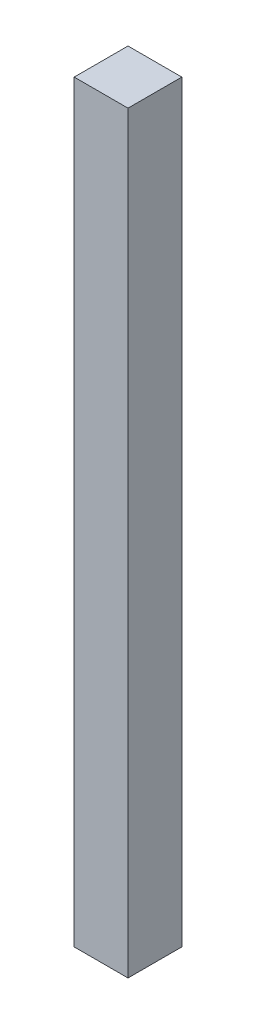
ISO-10303-21;
HEADER;
FILE_DESCRIPTION(('STEP AP214'),'2;1');
FILE_NAME('part.step','',(''),(''),'','','');
FILE_SCHEMA(('AUTOMOTIVE_DESIGN { 1 0 10303 214 1 1 1 1 }'));
ENDSEC;
DATA;
#1=APPLICATION_CONTEXT('core data for automotive mechanical design processes');
#2=APPLICATION_PROTOCOL_DEFINITION('international standard','automotive_design',2000,#1);
#3=PRODUCT_CONTEXT('',#1,'mechanical');
#4=PRODUCT('Part','Part','',(#3));
#5=PRODUCT_RELATED_PRODUCT_CATEGORY('part','',(#4));
#6=PRODUCT_DEFINITION_FORMATION('','',#4);
#7=PRODUCT_DEFINITION_CONTEXT('part definition',#1,'design');
#8=PRODUCT_DEFINITION('design','',#6,#7);
#9=PRODUCT_DEFINITION_SHAPE('','',#8);
#10=(LENGTH_UNIT() NAMED_UNIT(*) SI_UNIT(.MILLI.,.METRE.));
#11=(NAMED_UNIT(*) PLANE_ANGLE_UNIT() SI_UNIT($,.RADIAN.));
#12=(NAMED_UNIT(*) SI_UNIT($,.STERADIAN.) SOLID_ANGLE_UNIT());
#13=UNCERTAINTY_MEASURE_WITH_UNIT(LENGTH_MEASURE(1.E-05),#10,'distance_accuracy_value','');
#14=(GEOMETRIC_REPRESENTATION_CONTEXT(3) GLOBAL_UNCERTAINTY_ASSIGNED_CONTEXT((#13)) GLOBAL_UNIT_ASSIGNED_CONTEXT((#10,
#11,#12)) REPRESENTATION_CONTEXT('',''));
#15=CARTESIAN_POINT('',(0.,0.,0.));
#16=DIRECTION('',(0.,0.,1.));
#17=DIRECTION('',(1.,0.,0.));
#18=AXIS2_PLACEMENT_3D('',#15,#16,#17);
#19=CARTESIAN_POINT('',(0.,70.,0.));
#20=DIRECTION('',(1.,0.,0.));
#21=DIRECTION('',(0.,0.,-1.));
#22=AXIS2_PLACEMENT_3D('',#19,#20,#21);
#23=PLANE('',#22);
#24=DIRECTION('',(0.,0.,1.));
#25=VECTOR('',#24,1.);
#26=CARTESIAN_POINT('',(0.,0.,0.));
#27=LINE('',#26,#25);
#28=CARTESIAN_POINT('',(0.,0.,0.));
#29=VERTEX_POINT('',#28);
#30=CARTESIAN_POINT('',(0.,0.,5.));
#31=VERTEX_POINT('',#30);
#32=EDGE_CURVE('E96',#29,#31,#27,.T.);
#33=ORIENTED_EDGE('',*,*,#32,.T.);
#34=DIRECTION('',(0.,-1.,0.));
#35=VECTOR('',#34,1.);
#36=CARTESIAN_POINT('',(0.,70.,5.));
#37=LINE('',#36,#35);
#38=CARTESIAN_POINT('',(0.,70.,5.));
#39=VERTEX_POINT('',#38);
#40=EDGE_CURVE('E11',#39,#31,#37,.T.);
#41=ORIENTED_EDGE('',*,*,#40,.F.);
#42=DIRECTION('',(0.,0.,1.));
#43=VECTOR('',#42,1.);
#44=CARTESIAN_POINT('',(0.,70.,0.));
#45=LINE('',#44,#43);
#46=CARTESIAN_POINT('',(0.,70.,0.));
#47=VERTEX_POINT('',#46);
#48=EDGE_CURVE('E84',#47,#39,#45,.T.);
#49=ORIENTED_EDGE('',*,*,#48,.F.);
#50=DIRECTION('',(0.,-1.,0.));
#51=VECTOR('',#50,1.);
#52=CARTESIAN_POINT('',(0.,70.,0.));
#53=LINE('',#52,#51);
#54=EDGE_CURVE('E92',#47,#29,#53,.T.);
#55=ORIENTED_EDGE('',*,*,#54,.T.);
#56=EDGE_LOOP('',(#33,#41,#49,#55));
#57=FACE_BOUND('',#56,.T.);
#58=ADVANCED_FACE('F33',(#57),#23,.F.);
#59=CARTESIAN_POINT('',(0.,70.,5.));
#60=DIRECTION('',(0.,0.,-1.));
#61=DIRECTION('',(-1.,0.,0.));
#62=AXIS2_PLACEMENT_3D('',#59,#60,#61);
#63=PLANE('',#62);
#64=DIRECTION('',(1.,0.,0.));
#65=VECTOR('',#64,1.);
#66=CARTESIAN_POINT('',(0.,0.,5.));
#67=LINE('',#66,#65);
#68=CARTESIAN_POINT('',(5.,0.,5.));
#69=VERTEX_POINT('',#68);
#70=EDGE_CURVE('E88',#31,#69,#67,.T.);
#71=ORIENTED_EDGE('',*,*,#70,.T.);
#72=DIRECTION('',(0.,-1.,0.));
#73=VECTOR('',#72,1.);
#74=CARTESIAN_POINT('',(5.,70.,5.));
#75=LINE('',#74,#73);
#76=CARTESIAN_POINT('',(5.,70.,5.));
#77=VERTEX_POINT('',#76);
#78=EDGE_CURVE('E41',#77,#69,#75,.T.);
#79=ORIENTED_EDGE('',*,*,#78,.F.);
#80=DIRECTION('',(1.,0.,0.));
#81=VECTOR('',#80,1.);
#82=CARTESIAN_POINT('',(0.,70.,5.));
#83=LINE('',#82,#81);
#84=EDGE_CURVE('E79',#39,#77,#83,.T.);
#85=ORIENTED_EDGE('',*,*,#84,.F.);
#86=ORIENTED_EDGE('',*,*,#40,.T.);
#87=EDGE_LOOP('',(#71,#79,#85,#86));
#88=FACE_BOUND('',#87,.T.);
#89=ADVANCED_FACE('F87',(#88),#63,.F.);
#90=CARTESIAN_POINT('',(5.,70.,0.));
#91=DIRECTION('',(-1.,0.,0.));
#92=DIRECTION('',(0.,0.,1.));
#93=AXIS2_PLACEMENT_3D('',#90,#91,#92);
#94=PLANE('',#93);
#95=DIRECTION('',(0.,0.,-1.));
#96=VECTOR('',#95,1.);
#97=CARTESIAN_POINT('',(5.,0.,0.));
#98=LINE('',#97,#96);
#99=CARTESIAN_POINT('',(5.,0.,0.));
#100=VERTEX_POINT('',#99);
#101=EDGE_CURVE('E66',#69,#100,#98,.T.);
#102=ORIENTED_EDGE('',*,*,#101,.T.);
#103=DIRECTION('',(0.,-1.,0.));
#104=VECTOR('',#103,1.);
#105=CARTESIAN_POINT('',(5.,70.,0.));
#106=LINE('',#105,#104);
#107=CARTESIAN_POINT('',(5.,70.,0.));
#108=VERTEX_POINT('',#107);
#109=EDGE_CURVE('E89',#108,#100,#106,.T.);
#110=ORIENTED_EDGE('',*,*,#109,.F.);
#111=DIRECTION('',(0.,0.,-1.));
#112=VECTOR('',#111,1.);
#113=CARTESIAN_POINT('',(5.,70.,0.));
#114=LINE('',#113,#112);
#115=EDGE_CURVE('E82',#77,#108,#114,.T.);
#116=ORIENTED_EDGE('',*,*,#115,.F.);
#117=ORIENTED_EDGE('',*,*,#78,.T.);
#118=EDGE_LOOP('',(#102,#110,#116,#117));
#119=FACE_BOUND('',#118,.T.);
#120=ADVANCED_FACE('F90',(#119),#94,.F.);
#121=CARTESIAN_POINT('',(0.,70.,0.));
#122=DIRECTION('',(0.,0.,1.));
#123=DIRECTION('',(1.,0.,0.));
#124=AXIS2_PLACEMENT_3D('',#121,#122,#123);
#125=PLANE('',#124);
#126=DIRECTION('',(-1.,0.,0.));
#127=VECTOR('',#126,1.);
#128=CARTESIAN_POINT('',(0.,0.,0.));
#129=LINE('',#128,#127);
#130=EDGE_CURVE('E72',#100,#29,#129,.T.);
#131=ORIENTED_EDGE('',*,*,#130,.T.);
#132=ORIENTED_EDGE('',*,*,#54,.F.);
#133=DIRECTION('',(-1.,0.,0.));
#134=VECTOR('',#133,1.);
#135=CARTESIAN_POINT('',(0.,70.,0.));
#136=LINE('',#135,#134);
#137=EDGE_CURVE('E49',#108,#47,#136,.T.);
#138=ORIENTED_EDGE('',*,*,#137,.F.);
#139=ORIENTED_EDGE('',*,*,#109,.T.);
#140=EDGE_LOOP('',(#131,#132,#138,#139));
#141=FACE_BOUND('',#140,.T.);
#142=ADVANCED_FACE('F103',(#141),#125,.F.);
#143=CARTESIAN_POINT('',(0.,70.,0.));
#144=DIRECTION('',(0.,1.,0.));
#145=DIRECTION('',(0.,0.,1.));
#146=AXIS2_PLACEMENT_3D('',#143,#144,#145);
#147=PLANE('',#146);
#148=ORIENTED_EDGE('',*,*,#48,.T.);
#149=ORIENTED_EDGE('',*,*,#84,.T.);
#150=ORIENTED_EDGE('',*,*,#115,.T.);
#151=ORIENTED_EDGE('',*,*,#137,.T.);
#152=EDGE_LOOP('',(#148,#149,#150,#151));
#153=FACE_BOUND('',#152,.T.);
#154=ADVANCED_FACE('F80',(#153),#147,.T.);
#155=CARTESIAN_POINT('',(0.,0.,0.));
#156=DIRECTION('',(0.,1.,0.));
#157=DIRECTION('',(0.,0.,1.));
#158=AXIS2_PLACEMENT_3D('',#155,#156,#157);
#159=PLANE('',#158);
#160=ORIENTED_EDGE('',*,*,#32,.F.);
#161=ORIENTED_EDGE('',*,*,#130,.F.);
#162=ORIENTED_EDGE('',*,*,#101,.F.);
#163=ORIENTED_EDGE('',*,*,#70,.F.);
#164=EDGE_LOOP('',(#160,#161,#162,#163));
#165=FACE_BOUND('',#164,.T.);
#166=ADVANCED_FACE('F106',(#165),#159,.F.);
#167=CLOSED_SHELL('',(#58,#89,#120,#142,#154,#166));
#168=MANIFOLD_SOLID_BREP('B2',#167);
#169=ADVANCED_BREP_SHAPE_REPRESENTATION('',(#18,#168),#14);
#170=SHAPE_DEFINITION_REPRESENTATION(#9,#169);
ENDSEC;
END-ISO-10303-21;
